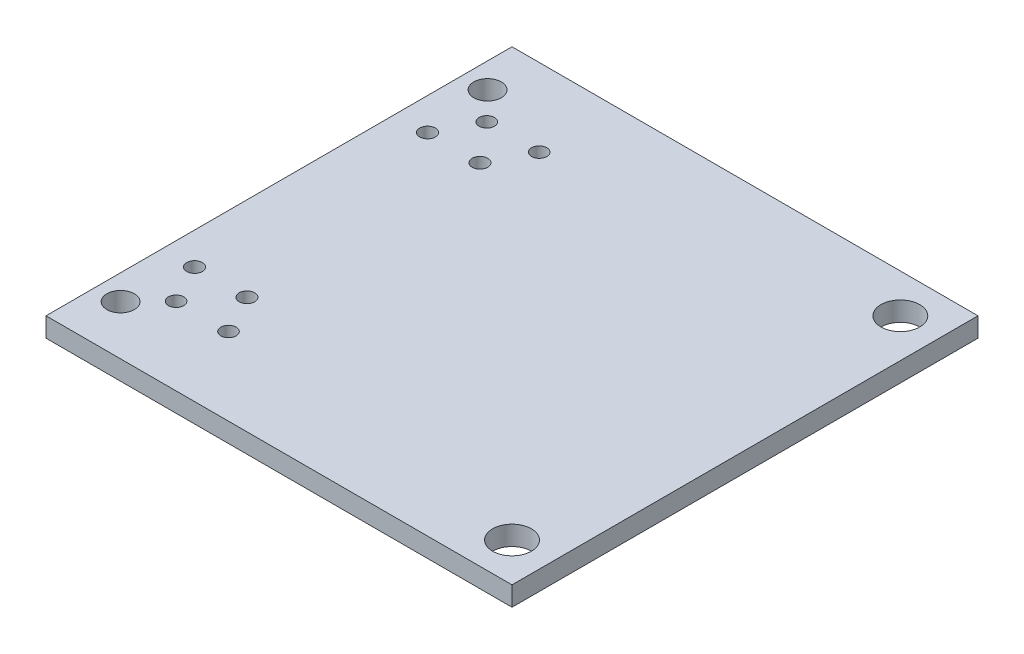
ISO-10303-21;
HEADER;
FILE_DESCRIPTION(('STEP AP214'),'2;1');
FILE_NAME('part.step','',(''),(''),'','','');
FILE_SCHEMA(('AUTOMOTIVE_DESIGN { 1 0 10303 214 1 1 1 1 }'));
ENDSEC;
DATA;
#1=APPLICATION_CONTEXT('core data for automotive mechanical design processes');
#2=APPLICATION_PROTOCOL_DEFINITION('international standard','automotive_design',2000,#1);
#3=PRODUCT_CONTEXT('',#1,'mechanical');
#4=PRODUCT('Part','Part','',(#3));
#5=PRODUCT_RELATED_PRODUCT_CATEGORY('part','',(#4));
#6=PRODUCT_DEFINITION_FORMATION('','',#4);
#7=PRODUCT_DEFINITION_CONTEXT('part definition',#1,'design');
#8=PRODUCT_DEFINITION('design','',#6,#7);
#9=PRODUCT_DEFINITION_SHAPE('','',#8);
#10=(LENGTH_UNIT() NAMED_UNIT(*) SI_UNIT(.MILLI.,.METRE.));
#11=(NAMED_UNIT(*) PLANE_ANGLE_UNIT() SI_UNIT($,.RADIAN.));
#12=(NAMED_UNIT(*) SI_UNIT($,.STERADIAN.) SOLID_ANGLE_UNIT());
#13=UNCERTAINTY_MEASURE_WITH_UNIT(LENGTH_MEASURE(1.E-05),#10,'distance_accuracy_value','');
#14=(GEOMETRIC_REPRESENTATION_CONTEXT(3) GLOBAL_UNCERTAINTY_ASSIGNED_CONTEXT((#13)) GLOBAL_UNIT_ASSIGNED_CONTEXT((#10,
#11,#12)) REPRESENTATION_CONTEXT('',''));
#15=CARTESIAN_POINT('',(0.,0.,0.));
#16=DIRECTION('',(0.,0.,1.));
#17=DIRECTION('',(1.,0.,0.));
#18=AXIS2_PLACEMENT_3D('',#15,#16,#17);
#19=CARTESIAN_POINT('',(0.,6.35,-152.4));
#20=DIRECTION('',(0.,-1.,0.));
#21=DIRECTION('',(0.,0.,-1.));
#22=AXIS2_PLACEMENT_3D('',#19,#20,#21);
#23=PLANE('',#22);
#24=CARTESIAN_POINT('',(27.6225,6.35,-38.1));
#25=DIRECTION('',(0.,1.,0.));
#26=DIRECTION('',(0.,0.,1.));
#27=AXIS2_PLACEMENT_3D('',#24,#25,#26);
#28=CIRCLE('',#27,2.5527);
#29=CARTESIAN_POINT('',(27.6225,6.35,-35.5473));
#30=VERTEX_POINT('',#29);
#31=EDGE_CURVE('E176',#30,#30,#28,.T.);
#32=ORIENTED_EDGE('',*,*,#31,.F.);
#33=EDGE_LOOP('',(#32));
#34=FACE_BOUND('',#33,.T.);
#35=CARTESIAN_POINT('',(10.4775,6.35,-38.1));
#36=DIRECTION('',(0.,1.,0.));
#37=DIRECTION('',(0.,0.,1.));
#38=AXIS2_PLACEMENT_3D('',#35,#36,#37);
#39=CIRCLE('',#38,2.5527);
#40=CARTESIAN_POINT('',(10.4775,6.35,-35.5473));
#41=VERTEX_POINT('',#40);
#42=EDGE_CURVE('E170',#41,#41,#39,.T.);
#43=ORIENTED_EDGE('',*,*,#42,.F.);
#44=EDGE_LOOP('',(#43));
#45=FACE_BOUND('',#44,.T.);
#46=CARTESIAN_POINT('',(27.6225,6.35,-114.3));
#47=DIRECTION('',(0.,1.,0.));
#48=DIRECTION('',(0.,0.,1.));
#49=AXIS2_PLACEMENT_3D('',#46,#47,#48);
#50=CIRCLE('',#49,2.55269999999999);
#51=CARTESIAN_POINT('',(27.6225,6.35,-111.7473));
#52=VERTEX_POINT('',#51);
#53=EDGE_CURVE('E164',#52,#52,#50,.T.);
#54=ORIENTED_EDGE('',*,*,#53,.F.);
#55=EDGE_LOOP('',(#54));
#56=FACE_BOUND('',#55,.T.);
#57=CARTESIAN_POINT('',(10.4775,6.35,-114.3));
#58=DIRECTION('',(0.,1.,0.));
#59=DIRECTION('',(0.,0.,1.));
#60=AXIS2_PLACEMENT_3D('',#57,#58,#59);
#61=CIRCLE('',#60,2.5527);
#62=CARTESIAN_POINT('',(10.4775,6.35,-111.7473));
#63=VERTEX_POINT('',#62);
#64=EDGE_CURVE('E158',#63,#63,#61,.T.);
#65=ORIENTED_EDGE('',*,*,#64,.F.);
#66=EDGE_LOOP('',(#65));
#67=FACE_BOUND('',#66,.T.);
#68=CARTESIAN_POINT('',(139.7,6.35,-12.7));
#69=DIRECTION('',(0.,1.,0.));
#70=DIRECTION('',(0.,0.,1.));
#71=AXIS2_PLACEMENT_3D('',#68,#69,#70);
#72=CIRCLE('',#71,6.35);
#73=CARTESIAN_POINT('',(139.7,6.35,-6.35));
#74=VERTEX_POINT('',#73);
#75=EDGE_CURVE('E143',#74,#74,#72,.T.);
#76=ORIENTED_EDGE('',*,*,#75,.F.);
#77=EDGE_LOOP('',(#76));
#78=FACE_BOUND('',#77,.T.);
#79=CARTESIAN_POINT('',(17.145,6.35,-127.));
#80=DIRECTION('',(0.,1.,0.));
#81=DIRECTION('',(0.,0.,1.));
#82=AXIS2_PLACEMENT_3D('',#79,#80,#81);
#83=CIRCLE('',#82,2.5);
#84=CARTESIAN_POINT('',(17.145,6.35,-124.5));
#85=VERTEX_POINT('',#84);
#86=EDGE_CURVE('E131',#85,#85,#83,.T.);
#87=ORIENTED_EDGE('',*,*,#86,.F.);
#88=EDGE_LOOP('',(#87));
#89=FACE_BOUND('',#88,.T.);
#90=CARTESIAN_POINT('',(17.145,6.35,-25.4));
#91=DIRECTION('',(0.,1.,0.));
#92=DIRECTION('',(0.,0.,1.));
#93=AXIS2_PLACEMENT_3D('',#90,#91,#92);
#94=CIRCLE('',#93,2.5);
#95=CARTESIAN_POINT('',(17.145,6.35,-22.9));
#96=VERTEX_POINT('',#95);
#97=EDGE_CURVE('E119',#96,#96,#94,.T.);
#98=ORIENTED_EDGE('',*,*,#97,.F.);
#99=EDGE_LOOP('',(#98));
#100=FACE_BOUND('',#99,.T.);
#101=CARTESIAN_POINT('',(8.200009,6.35,-136.19988));
#102=DIRECTION('',(0.,1.,0.));
#103=DIRECTION('',(0.,0.,1.));
#104=AXIS2_PLACEMENT_3D('',#101,#102,#103);
#105=CIRCLE('',#104,4.5);
#106=CARTESIAN_POINT('',(8.200009,6.35,-131.69988));
#107=VERTEX_POINT('',#106);
#108=EDGE_CURVE('E98',#107,#107,#105,.T.);
#109=ORIENTED_EDGE('',*,*,#108,.F.);
#110=EDGE_LOOP('',(#109));
#111=FACE_BOUND('',#110,.T.);
#112=DIRECTION('',(0.,0.,1.));
#113=VECTOR('',#112,1.);
#114=CARTESIAN_POINT('',(0.,6.35,0.));
#115=LINE('',#114,#113);
#116=CARTESIAN_POINT('',(0.,6.35,-152.4));
#117=VERTEX_POINT('',#116);
#118=CARTESIAN_POINT('',(0.,6.35,0.));
#119=VERTEX_POINT('',#118);
#120=EDGE_CURVE('E83',#117,#119,#115,.T.);
#121=ORIENTED_EDGE('',*,*,#120,.T.);
#122=DIRECTION('',(1.,0.,0.));
#123=VECTOR('',#122,1.);
#124=CARTESIAN_POINT('',(0.,6.35,0.));
#125=LINE('',#124,#123);
#126=CARTESIAN_POINT('',(152.4,6.35,0.));
#127=VERTEX_POINT('',#126);
#128=EDGE_CURVE('E78',#119,#127,#125,.T.);
#129=ORIENTED_EDGE('',*,*,#128,.T.);
#130=DIRECTION('',(0.,0.,-1.));
#131=VECTOR('',#130,1.);
#132=CARTESIAN_POINT('',(152.4,6.35,0.));
#133=LINE('',#132,#131);
#134=CARTESIAN_POINT('',(152.4,6.35,-152.4));
#135=VERTEX_POINT('',#134);
#136=EDGE_CURVE('E81',#127,#135,#133,.T.);
#137=ORIENTED_EDGE('',*,*,#136,.T.);
#138=DIRECTION('',(-1.,0.,0.));
#139=VECTOR('',#138,1.);
#140=CARTESIAN_POINT('',(0.,6.35,-152.4));
#141=LINE('',#140,#139);
#142=EDGE_CURVE('E48',#135,#117,#141,.T.);
#143=ORIENTED_EDGE('',*,*,#142,.T.);
#144=EDGE_LOOP('',(#121,#129,#137,#143));
#145=FACE_BOUND('',#144,.T.);
#146=CARTESIAN_POINT('',(8.200009,6.35,-16.200000112));
#147=DIRECTION('',(0.,1.,0.));
#148=DIRECTION('',(0.,0.,1.));
#149=AXIS2_PLACEMENT_3D('',#146,#147,#148);
#150=CIRCLE('',#149,4.5);
#151=CARTESIAN_POINT('',(8.200009,6.35,-11.700000112));
#152=VERTEX_POINT('',#151);
#153=EDGE_CURVE('E113',#152,#152,#150,.T.);
#154=ORIENTED_EDGE('',*,*,#153,.F.);
#155=EDGE_LOOP('',(#154));
#156=FACE_BOUND('',#155,.T.);
#157=CARTESIAN_POINT('',(34.29,6.35,-25.4));
#158=DIRECTION('',(0.,1.,0.));
#159=DIRECTION('',(0.,0.,1.));
#160=AXIS2_PLACEMENT_3D('',#157,#158,#159);
#161=CIRCLE('',#160,2.5);
#162=CARTESIAN_POINT('',(34.29,6.35,-22.9));
#163=VERTEX_POINT('',#162);
#164=EDGE_CURVE('E125',#163,#163,#161,.T.);
#165=ORIENTED_EDGE('',*,*,#164,.F.);
#166=EDGE_LOOP('',(#165));
#167=FACE_BOUND('',#166,.T.);
#168=CARTESIAN_POINT('',(34.29,6.35,-127.));
#169=DIRECTION('',(0.,1.,0.));
#170=DIRECTION('',(0.,0.,1.));
#171=AXIS2_PLACEMENT_3D('',#168,#169,#170);
#172=CIRCLE('',#171,2.5);
#173=CARTESIAN_POINT('',(34.29,6.35,-124.5));
#174=VERTEX_POINT('',#173);
#175=EDGE_CURVE('E137',#174,#174,#172,.T.);
#176=ORIENTED_EDGE('',*,*,#175,.F.);
#177=EDGE_LOOP('',(#176));
#178=FACE_BOUND('',#177,.T.);
#179=CARTESIAN_POINT('',(139.7,6.35,-139.7));
#180=DIRECTION('',(0.,1.,0.));
#181=DIRECTION('',(0.,0.,1.));
#182=AXIS2_PLACEMENT_3D('',#179,#180,#181);
#183=CIRCLE('',#182,6.34999999999999);
#184=CARTESIAN_POINT('',(139.7,6.35,-133.35));
#185=VERTEX_POINT('',#184);
#186=EDGE_CURVE('E149',#185,#185,#183,.T.);
#187=ORIENTED_EDGE('',*,*,#186,.F.);
#188=EDGE_LOOP('',(#187));
#189=FACE_BOUND('',#188,.T.);
#190=ADVANCED_FACE('F31',(#34,#45,#56,#67,#78,#89,#100,#111,#145,#156,#167,#178,#189),#23,.F.);
#191=CARTESIAN_POINT('',(0.,0.,-152.4));
#192=DIRECTION('',(0.,-1.,0.));
#193=DIRECTION('',(0.,0.,-1.));
#194=AXIS2_PLACEMENT_3D('',#191,#192,#193);
#195=PLANE('',#194);
#196=CARTESIAN_POINT('',(27.6225,0.,-38.1));
#197=DIRECTION('',(0.,1.,0.));
#198=DIRECTION('',(0.,0.,1.));
#199=AXIS2_PLACEMENT_3D('',#196,#197,#198);
#200=CIRCLE('',#199,2.5527);
#201=CARTESIAN_POINT('',(27.6225,0.,-35.5473));
#202=VERTEX_POINT('',#201);
#203=EDGE_CURVE('E173',#202,#202,#200,.T.);
#204=ORIENTED_EDGE('',*,*,#203,.T.);
#205=EDGE_LOOP('',(#204));
#206=FACE_BOUND('',#205,.T.);
#207=CARTESIAN_POINT('',(10.4775,0.,-38.1));
#208=DIRECTION('',(0.,1.,0.));
#209=DIRECTION('',(0.,0.,1.));
#210=AXIS2_PLACEMENT_3D('',#207,#208,#209);
#211=CIRCLE('',#210,2.5527);
#212=CARTESIAN_POINT('',(10.4775,0.,-35.5473));
#213=VERTEX_POINT('',#212);
#214=EDGE_CURVE('E167',#213,#213,#211,.T.);
#215=ORIENTED_EDGE('',*,*,#214,.T.);
#216=EDGE_LOOP('',(#215));
#217=FACE_BOUND('',#216,.T.);
#218=CARTESIAN_POINT('',(27.6225,0.,-114.3));
#219=DIRECTION('',(0.,1.,0.));
#220=DIRECTION('',(0.,0.,1.));
#221=AXIS2_PLACEMENT_3D('',#218,#219,#220);
#222=CIRCLE('',#221,2.55269999999999);
#223=CARTESIAN_POINT('',(27.6225,0.,-111.7473));
#224=VERTEX_POINT('',#223);
#225=EDGE_CURVE('E161',#224,#224,#222,.T.);
#226=ORIENTED_EDGE('',*,*,#225,.T.);
#227=EDGE_LOOP('',(#226));
#228=FACE_BOUND('',#227,.T.);
#229=CARTESIAN_POINT('',(10.4775,0.,-114.3));
#230=DIRECTION('',(0.,1.,0.));
#231=DIRECTION('',(0.,0.,1.));
#232=AXIS2_PLACEMENT_3D('',#229,#230,#231);
#233=CIRCLE('',#232,2.5527);
#234=CARTESIAN_POINT('',(10.4775,0.,-111.7473));
#235=VERTEX_POINT('',#234);
#236=EDGE_CURVE('E155',#235,#235,#233,.T.);
#237=ORIENTED_EDGE('',*,*,#236,.T.);
#238=EDGE_LOOP('',(#237));
#239=FACE_BOUND('',#238,.T.);
#240=CARTESIAN_POINT('',(139.7,0.,-12.7));
#241=DIRECTION('',(0.,1.,0.));
#242=DIRECTION('',(0.,0.,1.));
#243=AXIS2_PLACEMENT_3D('',#240,#241,#242);
#244=CIRCLE('',#243,6.35);
#245=CARTESIAN_POINT('',(139.7,0.,-6.35));
#246=VERTEX_POINT('',#245);
#247=EDGE_CURVE('E146',#246,#246,#244,.T.);
#248=ORIENTED_EDGE('',*,*,#247,.T.);
#249=EDGE_LOOP('',(#248));
#250=FACE_BOUND('',#249,.T.);
#251=CARTESIAN_POINT('',(17.145,0.,-127.));
#252=DIRECTION('',(0.,1.,0.));
#253=DIRECTION('',(0.,0.,1.));
#254=AXIS2_PLACEMENT_3D('',#251,#252,#253);
#255=CIRCLE('',#254,2.5);
#256=CARTESIAN_POINT('',(17.145,0.,-124.5));
#257=VERTEX_POINT('',#256);
#258=EDGE_CURVE('E134',#257,#257,#255,.T.);
#259=ORIENTED_EDGE('',*,*,#258,.T.);
#260=EDGE_LOOP('',(#259));
#261=FACE_BOUND('',#260,.T.);
#262=CARTESIAN_POINT('',(17.145,0.,-25.4));
#263=DIRECTION('',(0.,1.,0.));
#264=DIRECTION('',(0.,0.,1.));
#265=AXIS2_PLACEMENT_3D('',#262,#263,#264);
#266=CIRCLE('',#265,2.5);
#267=CARTESIAN_POINT('',(17.145,0.,-22.9));
#268=VERTEX_POINT('',#267);
#269=EDGE_CURVE('E122',#268,#268,#266,.T.);
#270=ORIENTED_EDGE('',*,*,#269,.T.);
#271=EDGE_LOOP('',(#270));
#272=FACE_BOUND('',#271,.T.);
#273=CARTESIAN_POINT('',(8.200009,0.,-136.19988));
#274=DIRECTION('',(0.,1.,0.));
#275=DIRECTION('',(0.,0.,1.));
#276=AXIS2_PLACEMENT_3D('',#273,#274,#275);
#277=CIRCLE('',#276,4.5);
#278=CARTESIAN_POINT('',(8.200009,0.,-131.69988));
#279=VERTEX_POINT('',#278);
#280=EDGE_CURVE('E110',#279,#279,#277,.T.);
#281=ORIENTED_EDGE('',*,*,#280,.T.);
#282=EDGE_LOOP('',(#281));
#283=FACE_BOUND('',#282,.T.);
#284=DIRECTION('',(0.,0.,1.));
#285=VECTOR('',#284,1.);
#286=CARTESIAN_POINT('',(0.,0.,0.));
#287=LINE('',#286,#285);
#288=CARTESIAN_POINT('',(0.,0.,-152.4));
#289=VERTEX_POINT('',#288);
#290=CARTESIAN_POINT('',(0.,0.,0.));
#291=VERTEX_POINT('',#290);
#292=EDGE_CURVE('E95',#289,#291,#287,.T.);
#293=ORIENTED_EDGE('',*,*,#292,.F.);
#294=DIRECTION('',(-1.,0.,0.));
#295=VECTOR('',#294,1.);
#296=CARTESIAN_POINT('',(0.,0.,-152.4));
#297=LINE('',#296,#295);
#298=CARTESIAN_POINT('',(152.4,0.,-152.4));
#299=VERTEX_POINT('',#298);
#300=EDGE_CURVE('E71',#299,#289,#297,.T.);
#301=ORIENTED_EDGE('',*,*,#300,.F.);
#302=DIRECTION('',(0.,0.,-1.));
#303=VECTOR('',#302,1.);
#304=CARTESIAN_POINT('',(152.4,0.,0.));
#305=LINE('',#304,#303);
#306=CARTESIAN_POINT('',(152.4,0.,0.));
#307=VERTEX_POINT('',#306);
#308=EDGE_CURVE('E65',#307,#299,#305,.T.);
#309=ORIENTED_EDGE('',*,*,#308,.F.);
#310=DIRECTION('',(1.,0.,0.));
#311=VECTOR('',#310,1.);
#312=CARTESIAN_POINT('',(0.,0.,0.));
#313=LINE('',#312,#311);
#314=EDGE_CURVE('E87',#291,#307,#313,.T.);
#315=ORIENTED_EDGE('',*,*,#314,.F.);
#316=EDGE_LOOP('',(#293,#301,#309,#315));
#317=FACE_BOUND('',#316,.T.);
#318=CARTESIAN_POINT('',(8.200009,0.,-16.200000112));
#319=DIRECTION('',(0.,1.,0.));
#320=DIRECTION('',(0.,0.,1.));
#321=AXIS2_PLACEMENT_3D('',#318,#319,#320);
#322=CIRCLE('',#321,4.5);
#323=CARTESIAN_POINT('',(8.200009,0.,-11.700000112));
#324=VERTEX_POINT('',#323);
#325=EDGE_CURVE('E116',#324,#324,#322,.T.);
#326=ORIENTED_EDGE('',*,*,#325,.T.);
#327=EDGE_LOOP('',(#326));
#328=FACE_BOUND('',#327,.T.);
#329=CARTESIAN_POINT('',(34.29,0.,-25.4));
#330=DIRECTION('',(0.,1.,0.));
#331=DIRECTION('',(0.,0.,1.));
#332=AXIS2_PLACEMENT_3D('',#329,#330,#331);
#333=CIRCLE('',#332,2.5);
#334=CARTESIAN_POINT('',(34.29,0.,-22.9));
#335=VERTEX_POINT('',#334);
#336=EDGE_CURVE('E128',#335,#335,#333,.T.);
#337=ORIENTED_EDGE('',*,*,#336,.T.);
#338=EDGE_LOOP('',(#337));
#339=FACE_BOUND('',#338,.T.);
#340=CARTESIAN_POINT('',(34.29,0.,-127.));
#341=DIRECTION('',(0.,1.,0.));
#342=DIRECTION('',(0.,0.,1.));
#343=AXIS2_PLACEMENT_3D('',#340,#341,#342);
#344=CIRCLE('',#343,2.5);
#345=CARTESIAN_POINT('',(34.29,0.,-124.5));
#346=VERTEX_POINT('',#345);
#347=EDGE_CURVE('E140',#346,#346,#344,.T.);
#348=ORIENTED_EDGE('',*,*,#347,.T.);
#349=EDGE_LOOP('',(#348));
#350=FACE_BOUND('',#349,.T.);
#351=CARTESIAN_POINT('',(139.7,0.,-139.7));
#352=DIRECTION('',(0.,1.,0.));
#353=DIRECTION('',(0.,0.,1.));
#354=AXIS2_PLACEMENT_3D('',#351,#352,#353);
#355=CIRCLE('',#354,6.34999999999999);
#356=CARTESIAN_POINT('',(139.7,0.,-133.35));
#357=VERTEX_POINT('',#356);
#358=EDGE_CURVE('E152',#357,#357,#355,.T.);
#359=ORIENTED_EDGE('',*,*,#358,.T.);
#360=EDGE_LOOP('',(#359));
#361=FACE_BOUND('',#360,.T.);
#362=ADVANCED_FACE('F106',(#206,#217,#228,#239,#250,#261,#272,#283,#317,#328,#339,#350,#361),
#195,.T.);
#363=CARTESIAN_POINT('',(0.,6.35,0.));
#364=DIRECTION('',(1.,0.,0.));
#365=DIRECTION('',(0.,0.,-1.));
#366=AXIS2_PLACEMENT_3D('',#363,#364,#365);
#367=PLANE('',#366);
#368=ORIENTED_EDGE('',*,*,#292,.T.);
#369=DIRECTION('',(0.,-1.,0.));
#370=VECTOR('',#369,1.);
#371=CARTESIAN_POINT('',(0.,6.35,0.));
#372=LINE('',#371,#370);
#373=EDGE_CURVE('E11',#119,#291,#372,.T.);
#374=ORIENTED_EDGE('',*,*,#373,.F.);
#375=ORIENTED_EDGE('',*,*,#120,.F.);
#376=DIRECTION('',(0.,-1.,0.));
#377=VECTOR('',#376,1.);
#378=CARTESIAN_POINT('',(0.,6.35,-152.4));
#379=LINE('',#378,#377);
#380=EDGE_CURVE('E91',#117,#289,#379,.T.);
#381=ORIENTED_EDGE('',*,*,#380,.T.);
#382=EDGE_LOOP('',(#368,#374,#375,#381));
#383=FACE_BOUND('',#382,.T.);
#384=ADVANCED_FACE('F33',(#383),#367,.F.);
#385=CARTESIAN_POINT('',(0.,6.35,0.));
#386=DIRECTION('',(0.,0.,-1.));
#387=DIRECTION('',(-1.,0.,0.));
#388=AXIS2_PLACEMENT_3D('',#385,#386,#387);
#389=PLANE('',#388);
#390=ORIENTED_EDGE('',*,*,#314,.T.);
#391=DIRECTION('',(0.,-1.,0.));
#392=VECTOR('',#391,1.);
#393=CARTESIAN_POINT('',(152.4,6.35,0.));
#394=LINE('',#393,#392);
#395=EDGE_CURVE('E40',#127,#307,#394,.T.);
#396=ORIENTED_EDGE('',*,*,#395,.F.);
#397=ORIENTED_EDGE('',*,*,#128,.F.);
#398=ORIENTED_EDGE('',*,*,#373,.T.);
#399=EDGE_LOOP('',(#390,#396,#397,#398));
#400=FACE_BOUND('',#399,.T.);
#401=ADVANCED_FACE('F86',(#400),#389,.F.);
#402=CARTESIAN_POINT('',(152.4,6.35,0.));
#403=DIRECTION('',(-1.,0.,0.));
#404=DIRECTION('',(0.,0.,1.));
#405=AXIS2_PLACEMENT_3D('',#402,#403,#404);
#406=PLANE('',#405);
#407=ORIENTED_EDGE('',*,*,#308,.T.);
#408=DIRECTION('',(0.,-1.,0.));
#409=VECTOR('',#408,1.);
#410=CARTESIAN_POINT('',(152.4,6.35,-152.4));
#411=LINE('',#410,#409);
#412=EDGE_CURVE('E88',#135,#299,#411,.T.);
#413=ORIENTED_EDGE('',*,*,#412,.F.);
#414=ORIENTED_EDGE('',*,*,#136,.F.);
#415=ORIENTED_EDGE('',*,*,#395,.T.);
#416=EDGE_LOOP('',(#407,#413,#414,#415));
#417=FACE_BOUND('',#416,.T.);
#418=ADVANCED_FACE('F89',(#417),#406,.F.);
#419=CARTESIAN_POINT('',(0.,6.35,-152.4));
#420=DIRECTION('',(0.,0.,1.));
#421=DIRECTION('',(1.,0.,0.));
#422=AXIS2_PLACEMENT_3D('',#419,#420,#421);
#423=PLANE('',#422);
#424=ORIENTED_EDGE('',*,*,#300,.T.);
#425=ORIENTED_EDGE('',*,*,#380,.F.);
#426=ORIENTED_EDGE('',*,*,#142,.F.);
#427=ORIENTED_EDGE('',*,*,#412,.T.);
#428=EDGE_LOOP('',(#424,#425,#426,#427));
#429=FACE_BOUND('',#428,.T.);
#430=ADVANCED_FACE('F103',(#429),#423,.F.);
#431=CARTESIAN_POINT('',(8.200009,6.35,-136.19988));
#432=DIRECTION('',(0.,-1.,0.));
#433=DIRECTION('',(0.,0.,-1.));
#434=AXIS2_PLACEMENT_3D('',#431,#432,#433);
#435=CYLINDRICAL_SURFACE('',#434,4.5);
#436=ORIENTED_EDGE('',*,*,#108,.T.);
#437=EDGE_LOOP('',(#436));
#438=FACE_BOUND('',#437,.T.);
#439=ORIENTED_EDGE('',*,*,#280,.F.);
#440=EDGE_LOOP('',(#439));
#441=FACE_BOUND('',#440,.T.);
#442=ADVANCED_FACE('F208',(#438,#441),#435,.F.);
#443=CARTESIAN_POINT('',(8.200009,6.35,-16.200000112));
#444=DIRECTION('',(0.,-1.,0.));
#445=DIRECTION('',(0.,0.,-1.));
#446=AXIS2_PLACEMENT_3D('',#443,#444,#445);
#447=CYLINDRICAL_SURFACE('',#446,4.5);
#448=ORIENTED_EDGE('',*,*,#153,.T.);
#449=EDGE_LOOP('',(#448));
#450=FACE_BOUND('',#449,.T.);
#451=ORIENTED_EDGE('',*,*,#325,.F.);
#452=EDGE_LOOP('',(#451));
#453=FACE_BOUND('',#452,.T.);
#454=ADVANCED_FACE('F211',(#450,#453),#447,.F.);
#455=CARTESIAN_POINT('',(17.145,6.35,-25.4));
#456=DIRECTION('',(0.,-1.,0.));
#457=DIRECTION('',(0.,0.,-1.));
#458=AXIS2_PLACEMENT_3D('',#455,#456,#457);
#459=CYLINDRICAL_SURFACE('',#458,2.5);
#460=ORIENTED_EDGE('',*,*,#97,.T.);
#461=EDGE_LOOP('',(#460));
#462=FACE_BOUND('',#461,.T.);
#463=ORIENTED_EDGE('',*,*,#269,.F.);
#464=EDGE_LOOP('',(#463));
#465=FACE_BOUND('',#464,.T.);
#466=ADVANCED_FACE('F247',(#462,#465),#459,.F.);
#467=CARTESIAN_POINT('',(34.29,6.35,-25.4));
#468=DIRECTION('',(0.,-1.,0.));
#469=DIRECTION('',(0.,0.,-1.));
#470=AXIS2_PLACEMENT_3D('',#467,#468,#469);
#471=CYLINDRICAL_SURFACE('',#470,2.5);
#472=ORIENTED_EDGE('',*,*,#164,.T.);
#473=EDGE_LOOP('',(#472));
#474=FACE_BOUND('',#473,.T.);
#475=ORIENTED_EDGE('',*,*,#336,.F.);
#476=EDGE_LOOP('',(#475));
#477=FACE_BOUND('',#476,.T.);
#478=ADVANCED_FACE('F255',(#474,#477),#471,.F.);
#479=CARTESIAN_POINT('',(17.145,6.35,-127.));
#480=DIRECTION('',(0.,-1.,0.));
#481=DIRECTION('',(0.,0.,-1.));
#482=AXIS2_PLACEMENT_3D('',#479,#480,#481);
#483=CYLINDRICAL_SURFACE('',#482,2.5);
#484=ORIENTED_EDGE('',*,*,#86,.T.);
#485=EDGE_LOOP('',(#484));
#486=FACE_BOUND('',#485,.T.);
#487=ORIENTED_EDGE('',*,*,#258,.F.);
#488=EDGE_LOOP('',(#487));
#489=FACE_BOUND('',#488,.T.);
#490=ADVANCED_FACE('F263',(#486,#489),#483,.F.);
#491=CARTESIAN_POINT('',(34.29,6.35,-127.));
#492=DIRECTION('',(0.,-1.,0.));
#493=DIRECTION('',(0.,0.,-1.));
#494=AXIS2_PLACEMENT_3D('',#491,#492,#493);
#495=CYLINDRICAL_SURFACE('',#494,2.5);
#496=ORIENTED_EDGE('',*,*,#175,.T.);
#497=EDGE_LOOP('',(#496));
#498=FACE_BOUND('',#497,.T.);
#499=ORIENTED_EDGE('',*,*,#347,.F.);
#500=EDGE_LOOP('',(#499));
#501=FACE_BOUND('',#500,.T.);
#502=ADVANCED_FACE('F271',(#498,#501),#495,.F.);
#503=CARTESIAN_POINT('',(139.7,6.35,-12.7));
#504=DIRECTION('',(0.,-1.,0.));
#505=DIRECTION('',(0.,0.,-1.));
#506=AXIS2_PLACEMENT_3D('',#503,#504,#505);
#507=CYLINDRICAL_SURFACE('',#506,6.35);
#508=ORIENTED_EDGE('',*,*,#75,.T.);
#509=EDGE_LOOP('',(#508));
#510=FACE_BOUND('',#509,.T.);
#511=ORIENTED_EDGE('',*,*,#247,.F.);
#512=EDGE_LOOP('',(#511));
#513=FACE_BOUND('',#512,.T.);
#514=ADVANCED_FACE('F279',(#510,#513),#507,.F.);
#515=CARTESIAN_POINT('',(139.7,6.35,-139.7));
#516=DIRECTION('',(0.,-1.,0.));
#517=DIRECTION('',(0.,0.,-1.));
#518=AXIS2_PLACEMENT_3D('',#515,#516,#517);
#519=CYLINDRICAL_SURFACE('',#518,6.34999999999999);
#520=ORIENTED_EDGE('',*,*,#186,.T.);
#521=EDGE_LOOP('',(#520));
#522=FACE_BOUND('',#521,.T.);
#523=ORIENTED_EDGE('',*,*,#358,.F.);
#524=EDGE_LOOP('',(#523));
#525=FACE_BOUND('',#524,.T.);
#526=ADVANCED_FACE('F287',(#522,#525),#519,.F.);
#527=CARTESIAN_POINT('',(10.4775,0.,-114.3));
#528=DIRECTION('',(0.,1.,0.));
#529=DIRECTION('',(0.,0.,1.));
#530=AXIS2_PLACEMENT_3D('',#527,#528,#529);
#531=CYLINDRICAL_SURFACE('',#530,2.5527);
#532=ORIENTED_EDGE('',*,*,#236,.F.);
#533=EDGE_LOOP('',(#532));
#534=FACE_BOUND('',#533,.T.);
#535=ORIENTED_EDGE('',*,*,#64,.T.);
#536=EDGE_LOOP('',(#535));
#537=FACE_BOUND('',#536,.T.);
#538=ADVANCED_FACE('F295',(#534,#537),#531,.F.);
#539=CARTESIAN_POINT('',(27.6225,0.,-114.3));
#540=DIRECTION('',(0.,1.,0.));
#541=DIRECTION('',(0.,0.,1.));
#542=AXIS2_PLACEMENT_3D('',#539,#540,#541);
#543=CYLINDRICAL_SURFACE('',#542,2.55269999999999);
#544=ORIENTED_EDGE('',*,*,#225,.F.);
#545=EDGE_LOOP('',(#544));
#546=FACE_BOUND('',#545,.T.);
#547=ORIENTED_EDGE('',*,*,#53,.T.);
#548=EDGE_LOOP('',(#547));
#549=FACE_BOUND('',#548,.T.);
#550=ADVANCED_FACE('F304',(#546,#549),#543,.F.);
#551=CARTESIAN_POINT('',(10.4775,0.,-38.1));
#552=DIRECTION('',(0.,1.,0.));
#553=DIRECTION('',(0.,0.,1.));
#554=AXIS2_PLACEMENT_3D('',#551,#552,#553);
#555=CYLINDRICAL_SURFACE('',#554,2.5527);
#556=ORIENTED_EDGE('',*,*,#214,.F.);
#557=EDGE_LOOP('',(#556));
#558=FACE_BOUND('',#557,.T.);
#559=ORIENTED_EDGE('',*,*,#42,.T.);
#560=EDGE_LOOP('',(#559));
#561=FACE_BOUND('',#560,.T.);
#562=ADVANCED_FACE('F187',(#558,#561),#555,.F.);
#563=CARTESIAN_POINT('',(27.6225,0.,-38.1));
#564=DIRECTION('',(0.,1.,0.));
#565=DIRECTION('',(0.,0.,1.));
#566=AXIS2_PLACEMENT_3D('',#563,#564,#565);
#567=CYLINDRICAL_SURFACE('',#566,2.5527);
#568=ORIENTED_EDGE('',*,*,#203,.F.);
#569=EDGE_LOOP('',(#568));
#570=FACE_BOUND('',#569,.T.);
#571=ORIENTED_EDGE('',*,*,#31,.T.);
#572=EDGE_LOOP('',(#571));
#573=FACE_BOUND('',#572,.T.);
#574=ADVANCED_FACE('F184',(#570,#573),#567,.F.);
#575=CLOSED_SHELL('',(#190,#362,#384,#401,#418,#430,#442,#454,#466,#478,#490,#502,#514,#526,
#538,#550,#562,#574));
#576=MANIFOLD_SOLID_BREP('B2',#575);
#577=ADVANCED_BREP_SHAPE_REPRESENTATION('',(#18,#576),#14);
#578=SHAPE_DEFINITION_REPRESENTATION(#9,#577);
ENDSEC;
END-ISO-10303-21;
